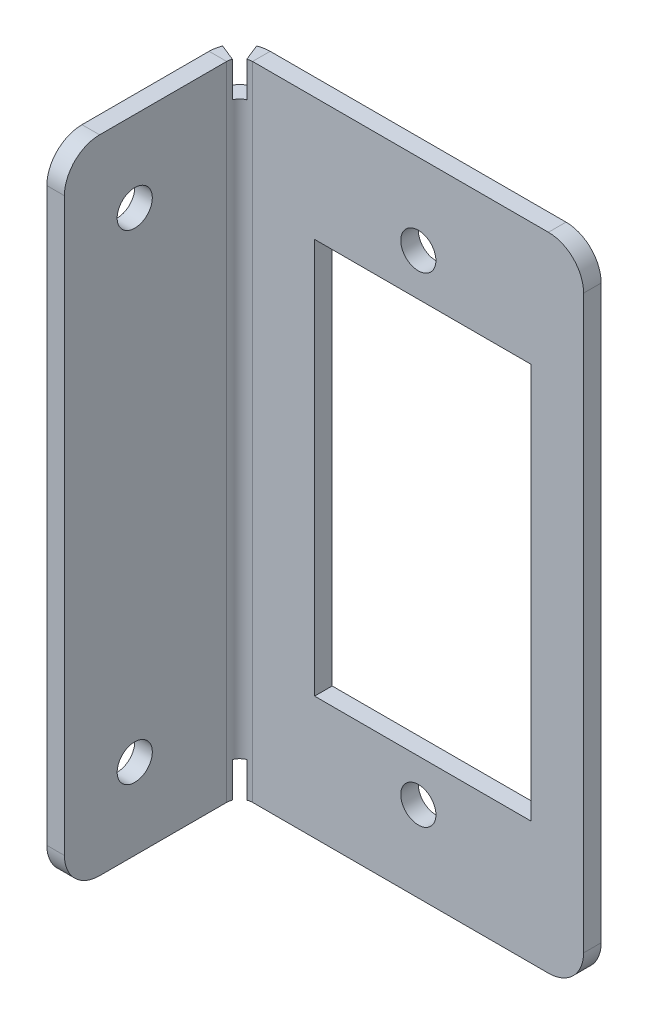
ISO-10303-21;
HEADER;
FILE_DESCRIPTION(('STEP AP214'),'2;1');
FILE_NAME('part.step','',(''),(''),'','','');
FILE_SCHEMA(('AUTOMOTIVE_DESIGN { 1 0 10303 214 1 1 1 1 }'));
ENDSEC;
DATA;
#1=APPLICATION_CONTEXT('core data for automotive mechanical design processes');
#2=APPLICATION_PROTOCOL_DEFINITION('international standard','automotive_design',2000,#1);
#3=PRODUCT_CONTEXT('',#1,'mechanical');
#4=PRODUCT('Part','Part','',(#3));
#5=PRODUCT_RELATED_PRODUCT_CATEGORY('part','',(#4));
#6=PRODUCT_DEFINITION_FORMATION('','',#4);
#7=PRODUCT_DEFINITION_CONTEXT('part definition',#1,'design');
#8=PRODUCT_DEFINITION('design','',#6,#7);
#9=PRODUCT_DEFINITION_SHAPE('','',#8);
#10=(LENGTH_UNIT() NAMED_UNIT(*) SI_UNIT(.MILLI.,.METRE.));
#11=(NAMED_UNIT(*) PLANE_ANGLE_UNIT() SI_UNIT($,.RADIAN.));
#12=(NAMED_UNIT(*) SI_UNIT($,.STERADIAN.) SOLID_ANGLE_UNIT());
#13=UNCERTAINTY_MEASURE_WITH_UNIT(LENGTH_MEASURE(1.E-05),#10,'distance_accuracy_value','');
#14=(GEOMETRIC_REPRESENTATION_CONTEXT(3) GLOBAL_UNCERTAINTY_ASSIGNED_CONTEXT((#13)) GLOBAL_UNIT_ASSIGNED_CONTEXT((#10,
#11,#12)) REPRESENTATION_CONTEXT('',''));
#15=CARTESIAN_POINT('',(0.,0.,0.));
#16=DIRECTION('',(0.,0.,1.));
#17=DIRECTION('',(1.,0.,0.));
#18=AXIS2_PLACEMENT_3D('',#15,#16,#17);
#19=CARTESIAN_POINT('',(176.999912259657,-94.9485687267,0.265376631142705));
#20=DIRECTION('',(0.,-1.,0.));
#21=DIRECTION('',(-1.,0.,0.));
#22=AXIS2_PLACEMENT_3D('',#19,#20,#21);
#23=PLANE('',#22);
#24=DIRECTION('',(0.,0.,-1.));
#25=VECTOR('',#24,1.);
#26=CARTESIAN_POINT('',(176.999912259657,-94.9485687267,0.265376631142705));
#27=LINE('',#26,#25);
#28=CARTESIAN_POINT('',(176.999912259657,-94.9485687267,7.96537663114272));
#29=VERTEX_POINT('',#28);
#30=CARTESIAN_POINT('',(176.999912259657,-94.9485687267,0.736600000000004));
#31=VERTEX_POINT('',#30);
#32=EDGE_CURVE('E380',#29,#31,#27,.T.);
#33=ORIENTED_EDGE('',*,*,#32,.T.);
#34=DIRECTION('',(1.,0.,0.));
#35=VECTOR('',#34,1.);
#36=CARTESIAN_POINT('',(176.999912259657,-94.9485687267,0.736600000000004));
#37=LINE('',#36,#35);
#38=CARTESIAN_POINT('',(177.999912259657,-94.9485687267,0.736600000000004));
#39=VERTEX_POINT('',#38);
#40=EDGE_CURVE('E12',#31,#39,#37,.T.);
#41=ORIENTED_EDGE('',*,*,#40,.T.);
#42=DIRECTION('',(0.,0.,-1.));
#43=VECTOR('',#42,1.);
#44=CARTESIAN_POINT('',(177.999912259657,-94.9485687267,0.265376631142705));
#45=LINE('',#44,#43);
#46=CARTESIAN_POINT('',(177.999912259657,-94.9485687267,7.96537663114272));
#47=VERTEX_POINT('',#46);
#48=EDGE_CURVE('E57',#47,#39,#45,.T.);
#49=ORIENTED_EDGE('',*,*,#48,.F.);
#50=DIRECTION('',(1.,0.,0.));
#51=VECTOR('',#50,1.);
#52=CARTESIAN_POINT('',(176.999912259657,-94.9485687267,7.96537663114272));
#53=LINE('',#52,#51);
#54=EDGE_CURVE('E388',#29,#47,#53,.T.);
#55=ORIENTED_EDGE('',*,*,#54,.F.);
#56=EDGE_LOOP('',(#33,#41,#49,#55));
#57=FACE_BOUND('',#56,.T.);
#58=ADVANCED_FACE('F41',(#57),#23,.T.);
#59=CARTESIAN_POINT('',(176.999912259657,-58.4483931478,7.96537663114272));
#60=DIRECTION('',(0.,1.,0.));
#61=DIRECTION('',(1.,0.,0.));
#62=AXIS2_PLACEMENT_3D('',#59,#60,#61);
#63=PLANE('',#62);
#64=DIRECTION('',(0.,0.,1.));
#65=VECTOR('',#64,1.);
#66=CARTESIAN_POINT('',(177.999912259657,-58.4483931478,7.96537663114272));
#67=LINE('',#66,#65);
#68=CARTESIAN_POINT('',(177.999912259657,-58.4483931478,0.736600000000004));
#69=VERTEX_POINT('',#68);
#70=CARTESIAN_POINT('',(177.999912259657,-58.4483931478,7.96537663114272));
#71=VERTEX_POINT('',#70);
#72=EDGE_CURVE('E64',#69,#71,#67,.T.);
#73=ORIENTED_EDGE('',*,*,#72,.F.);
#74=DIRECTION('',(-1.,0.,0.));
#75=VECTOR('',#74,1.);
#76=CARTESIAN_POINT('',(176.999912259657,-58.4483931478,0.736600000000004));
#77=LINE('',#76,#75);
#78=CARTESIAN_POINT('',(176.999912259657,-58.4483931478,0.736600000000041));
#79=VERTEX_POINT('',#78);
#80=EDGE_CURVE('E404',#69,#79,#77,.T.);
#81=ORIENTED_EDGE('',*,*,#80,.T.);
#82=DIRECTION('',(0.,0.,1.));
#83=VECTOR('',#82,1.);
#84=CARTESIAN_POINT('',(176.999912259657,-58.4483931478,7.96537663114272));
#85=LINE('',#84,#83);
#86=CARTESIAN_POINT('',(176.999912259657,-58.4483931478,7.96537663114272));
#87=VERTEX_POINT('',#86);
#88=EDGE_CURVE('E44',#79,#87,#85,.T.);
#89=ORIENTED_EDGE('',*,*,#88,.T.);
#90=DIRECTION('',(1.,0.,0.));
#91=VECTOR('',#90,1.);
#92=CARTESIAN_POINT('',(176.999912259657,-58.4483931478,7.96537663114272));
#93=LINE('',#92,#91);
#94=EDGE_CURVE('E400',#87,#71,#93,.T.);
#95=ORIENTED_EDGE('',*,*,#94,.T.);
#96=EDGE_LOOP('',(#73,#81,#89,#95));
#97=FACE_BOUND('',#96,.T.);
#98=ADVANCED_FACE('F415',(#97),#63,.T.);
#99=CARTESIAN_POINT('',(177.999912259657,-92.9485687267,7.96537663114269));
#100=DIRECTION('',(1.,0.,0.));
#101=DIRECTION('',(0.,0.,-1.));
#102=AXIS2_PLACEMENT_3D('',#99,#100,#101);
#103=PLANE('',#102);
#104=CARTESIAN_POINT('',(177.999912259657,-90.3485687267,5.96537663114272));
#105=DIRECTION('',(1.,0.,0.));
#106=DIRECTION('',(0.,0.,-1.));
#107=AXIS2_PLACEMENT_3D('',#104,#105,#106);
#108=CIRCLE('',#107,1.00000000000003);
#109=CARTESIAN_POINT('',(177.999912259657,-90.3485687267,4.96537663114269));
#110=VERTEX_POINT('',#109);
#111=EDGE_CURVE('E368',#110,#110,#108,.T.);
#112=ORIENTED_EDGE('',*,*,#111,.F.);
#113=EDGE_LOOP('',(#112));
#114=FACE_BOUND('',#113,.T.);
#115=CARTESIAN_POINT('',(177.999912259657,-63.0483931478,5.96537663114272));
#116=DIRECTION('',(1.,0.,0.));
#117=DIRECTION('',(0.,0.,-1.));
#118=AXIS2_PLACEMENT_3D('',#115,#116,#117);
#119=CIRCLE('',#118,1.);
#120=CARTESIAN_POINT('',(177.999912259657,-63.0483931478,4.96537663114271));
#121=VERTEX_POINT('',#120);
#122=EDGE_CURVE('E277',#121,#121,#119,.T.);
#123=ORIENTED_EDGE('',*,*,#122,.F.);
#124=EDGE_LOOP('',(#123));
#125=FACE_BOUND('',#124,.T.);
#126=ORIENTED_EDGE('',*,*,#48,.T.);
#127=DIRECTION('',(0.,1.,0.));
#128=VECTOR('',#127,1.);
#129=CARTESIAN_POINT('',(177.999912259657,-92.9485687267,0.736600000000004));
#130=LINE('',#129,#128);
#131=EDGE_CURVE('E49',#39,#69,#130,.T.);
#132=ORIENTED_EDGE('',*,*,#131,.T.);
#133=ORIENTED_EDGE('',*,*,#72,.T.);
#134=CARTESIAN_POINT('',(177.999912259657,-60.4483931478001,7.96537663114266));
#135=DIRECTION('',(1.,0.,0.));
#136=DIRECTION('',(0.,0.,-1.));
#137=AXIS2_PLACEMENT_3D('',#134,#135,#136);
#138=CIRCLE('',#137,2.00000000000006);
#139=CARTESIAN_POINT('',(177.999912259657,-60.4483931478,9.96537663114272));
#140=VERTEX_POINT('',#139);
#141=EDGE_CURVE('E390',#71,#140,#138,.T.);
#142=ORIENTED_EDGE('',*,*,#141,.T.);
#143=DIRECTION('',(0.,-1.,0.));
#144=VECTOR('',#143,1.);
#145=CARTESIAN_POINT('',(177.999912259657,-60.4483931478,9.96537663114272));
#146=LINE('',#145,#144);
#147=CARTESIAN_POINT('',(177.999912259657,-92.9485687267,9.96537663114272));
#148=VERTEX_POINT('',#147);
#149=EDGE_CURVE('E381',#140,#148,#146,.T.);
#150=ORIENTED_EDGE('',*,*,#149,.T.);
#151=CARTESIAN_POINT('',(177.999912259657,-92.9485687267,7.96537663114269));
#152=DIRECTION('',(1.,0.,0.));
#153=DIRECTION('',(0.,0.,-1.));
#154=AXIS2_PLACEMENT_3D('',#151,#152,#153);
#155=CIRCLE('',#154,2.00000000000003);
#156=EDGE_CURVE('E374',#148,#47,#155,.T.);
#157=ORIENTED_EDGE('',*,*,#156,.T.);
#158=EDGE_LOOP('',(#126,#132,#133,#142,#150,#157));
#159=FACE_BOUND('',#158,.T.);
#160=ADVANCED_FACE('F409',(#114,#125,#159),#103,.T.);
#161=CARTESIAN_POINT('',(176.999912259657,-92.9485687267,7.96537663114269));
#162=DIRECTION('',(1.,0.,0.));
#163=DIRECTION('',(0.,0.,-1.));
#164=AXIS2_PLACEMENT_3D('',#161,#162,#163);
#165=CYLINDRICAL_SURFACE('',#164,2.00000000000003);
#166=ORIENTED_EDGE('',*,*,#156,.F.);
#167=DIRECTION('',(1.,0.,0.));
#168=VECTOR('',#167,1.);
#169=CARTESIAN_POINT('',(176.999912259657,-92.9485687267,9.96537663114272));
#170=LINE('',#169,#168);
#171=CARTESIAN_POINT('',(176.999912259657,-92.9485687267,9.96537663114272));
#172=VERTEX_POINT('',#171);
#173=EDGE_CURVE('E395',#172,#148,#170,.T.);
#174=ORIENTED_EDGE('',*,*,#173,.F.);
#175=CARTESIAN_POINT('',(176.999912259657,-92.9485687267,7.96537663114269));
#176=DIRECTION('',(1.,0.,0.));
#177=DIRECTION('',(0.,0.,-1.));
#178=AXIS2_PLACEMENT_3D('',#175,#176,#177);
#179=CIRCLE('',#178,2.00000000000003);
#180=EDGE_CURVE('E377',#172,#29,#179,.T.);
#181=ORIENTED_EDGE('',*,*,#180,.T.);
#182=ORIENTED_EDGE('',*,*,#54,.T.);
#183=EDGE_LOOP('',(#166,#174,#181,#182));
#184=FACE_BOUND('',#183,.T.);
#185=ADVANCED_FACE('F425',(#184),#165,.T.);
#186=CARTESIAN_POINT('',(176.999912259657,-60.4483931478,9.96537663114272));
#187=DIRECTION('',(0.,0.,1.));
#188=DIRECTION('',(1.,0.,0.));
#189=AXIS2_PLACEMENT_3D('',#186,#187,#188);
#190=PLANE('',#189);
#191=ORIENTED_EDGE('',*,*,#149,.F.);
#192=DIRECTION('',(1.,0.,0.));
#193=VECTOR('',#192,1.);
#194=CARTESIAN_POINT('',(176.999912259657,-60.4483931478,9.96537663114272));
#195=LINE('',#194,#193);
#196=CARTESIAN_POINT('',(176.999912259657,-60.4483931478,9.96537663114272));
#197=VERTEX_POINT('',#196);
#198=EDGE_CURVE('E398',#197,#140,#195,.T.);
#199=ORIENTED_EDGE('',*,*,#198,.F.);
#200=DIRECTION('',(0.,-1.,0.));
#201=VECTOR('',#200,1.);
#202=CARTESIAN_POINT('',(176.999912259657,-60.4483931478,9.96537663114272));
#203=LINE('',#202,#201);
#204=EDGE_CURVE('E385',#197,#172,#203,.T.);
#205=ORIENTED_EDGE('',*,*,#204,.T.);
#206=ORIENTED_EDGE('',*,*,#173,.T.);
#207=EDGE_LOOP('',(#191,#199,#205,#206));
#208=FACE_BOUND('',#207,.T.);
#209=ADVANCED_FACE('F422',(#208),#190,.T.);
#210=CARTESIAN_POINT('',(176.999912259657,-60.4483931478001,7.96537663114266));
#211=DIRECTION('',(1.,0.,0.));
#212=DIRECTION('',(0.,0.,-1.));
#213=AXIS2_PLACEMENT_3D('',#210,#211,#212);
#214=CYLINDRICAL_SURFACE('',#213,2.00000000000006);
#215=ORIENTED_EDGE('',*,*,#141,.F.);
#216=ORIENTED_EDGE('',*,*,#94,.F.);
#217=CARTESIAN_POINT('',(176.999912259657,-60.4483931478001,7.96537663114266));
#218=DIRECTION('',(1.,0.,0.));
#219=DIRECTION('',(0.,0.,-1.));
#220=AXIS2_PLACEMENT_3D('',#217,#218,#219);
#221=CIRCLE('',#220,2.00000000000006);
#222=EDGE_CURVE('E382',#87,#197,#221,.T.);
#223=ORIENTED_EDGE('',*,*,#222,.T.);
#224=ORIENTED_EDGE('',*,*,#198,.T.);
#225=EDGE_LOOP('',(#215,#216,#223,#224));
#226=FACE_BOUND('',#225,.T.);
#227=ADVANCED_FACE('F419',(#226),#214,.T.);
#228=CARTESIAN_POINT('',(176.999912259657,-92.9485687267,7.96537663114269));
#229=DIRECTION('',(1.,0.,0.));
#230=DIRECTION('',(0.,0.,-1.));
#231=AXIS2_PLACEMENT_3D('',#228,#229,#230);
#232=PLANE('',#231);
#233=DIRECTION('',(0.,1.,0.));
#234=VECTOR('',#233,1.);
#235=CARTESIAN_POINT('',(176.999912259657,-92.9485687267,0.736600000000004));
#236=LINE('',#235,#234);
#237=EDGE_CURVE('E397',#31,#79,#236,.T.);
#238=ORIENTED_EDGE('',*,*,#237,.F.);
#239=ORIENTED_EDGE('',*,*,#32,.F.);
#240=ORIENTED_EDGE('',*,*,#180,.F.);
#241=ORIENTED_EDGE('',*,*,#204,.F.);
#242=ORIENTED_EDGE('',*,*,#222,.F.);
#243=ORIENTED_EDGE('',*,*,#88,.F.);
#244=EDGE_LOOP('',(#238,#239,#240,#241,#242,#243));
#245=FACE_BOUND('',#244,.T.);
#246=CARTESIAN_POINT('',(176.999912259657,-63.0483931478,5.96537663114272));
#247=DIRECTION('',(1.,0.,0.));
#248=DIRECTION('',(0.,0.,-1.));
#249=AXIS2_PLACEMENT_3D('',#246,#247,#248);
#250=CIRCLE('',#249,1.);
#251=CARTESIAN_POINT('',(176.999912259657,-63.0483931478,4.96537663114271));
#252=VERTEX_POINT('',#251);
#253=EDGE_CURVE('E365',#252,#252,#250,.T.);
#254=ORIENTED_EDGE('',*,*,#253,.T.);
#255=EDGE_LOOP('',(#254));
#256=FACE_BOUND('',#255,.T.);
#257=CARTESIAN_POINT('',(176.999912259657,-90.3485687267,5.96537663114272));
#258=DIRECTION('',(1.,0.,0.));
#259=DIRECTION('',(0.,0.,-1.));
#260=AXIS2_PLACEMENT_3D('',#257,#258,#259);
#261=CIRCLE('',#260,1.00000000000003);
#262=CARTESIAN_POINT('',(176.999912259657,-90.3485687267,4.96537663114269));
#263=VERTEX_POINT('',#262);
#264=EDGE_CURVE('E371',#263,#263,#261,.T.);
#265=ORIENTED_EDGE('',*,*,#264,.T.);
#266=EDGE_LOOP('',(#265));
#267=FACE_BOUND('',#266,.T.);
#268=ADVANCED_FACE('F440',(#245,#256,#267),#232,.F.);
#269=CARTESIAN_POINT('',(176.999912259657,-90.3485687267,5.96537663114272));
#270=DIRECTION('',(1.,0.,0.));
#271=DIRECTION('',(0.,0.,-1.));
#272=AXIS2_PLACEMENT_3D('',#269,#270,#271);
#273=CYLINDRICAL_SURFACE('',#272,1.00000000000003);
#274=ORIENTED_EDGE('',*,*,#264,.F.);
#275=EDGE_LOOP('',(#274));
#276=FACE_BOUND('',#275,.T.);
#277=ORIENTED_EDGE('',*,*,#111,.T.);
#278=EDGE_LOOP('',(#277));
#279=FACE_BOUND('',#278,.T.);
#280=ADVANCED_FACE('F507',(#276,#279),#273,.F.);
#281=CARTESIAN_POINT('',(176.999912259657,-63.0483931478,5.96537663114272));
#282=DIRECTION('',(1.,0.,0.));
#283=DIRECTION('',(0.,0.,-1.));
#284=AXIS2_PLACEMENT_3D('',#281,#282,#283);
#285=CYLINDRICAL_SURFACE('',#284,1.);
#286=ORIENTED_EDGE('',*,*,#253,.F.);
#287=EDGE_LOOP('',(#286));
#288=FACE_BOUND('',#287,.T.);
#289=ORIENTED_EDGE('',*,*,#122,.T.);
#290=EDGE_LOOP('',(#289));
#291=FACE_BOUND('',#290,.T.);
#292=ADVANCED_FACE('F516',(#288,#291),#285,.F.);
#293=CARTESIAN_POINT('',(195.5652888908,-92.9485687267,-1.));
#294=DIRECTION('',(0.,0.,1.));
#295=DIRECTION('',(1.,0.,0.));
#296=AXIS2_PLACEMENT_3D('',#293,#294,#295);
#297=CYLINDRICAL_SURFACE('',#296,2.);
#298=CARTESIAN_POINT('',(195.5652888908,-92.9485687267,0.));
#299=DIRECTION('',(0.,0.,1.));
#300=DIRECTION('',(1.,0.,0.));
#301=AXIS2_PLACEMENT_3D('',#298,#299,#300);
#302=CIRCLE('',#301,2.);
#303=CARTESIAN_POINT('',(195.5652888908,-94.9485687267,0.));
#304=VERTEX_POINT('',#303);
#305=CARTESIAN_POINT('',(197.5652888908,-92.9485687267,0.));
#306=VERTEX_POINT('',#305);
#307=EDGE_CURVE('E288',#304,#306,#302,.T.);
#308=ORIENTED_EDGE('',*,*,#307,.F.);
#309=DIRECTION('',(0.,0.,1.));
#310=VECTOR('',#309,1.);
#311=CARTESIAN_POINT('',(195.5652888908,-94.9485687267,-1.));
#312=LINE('',#311,#310);
#313=CARTESIAN_POINT('',(195.5652888908,-94.9485687267,-1.));
#314=VERTEX_POINT('',#313);
#315=EDGE_CURVE('E274',#314,#304,#312,.T.);
#316=ORIENTED_EDGE('',*,*,#315,.F.);
#317=CARTESIAN_POINT('',(195.5652888908,-92.9485687267,-1.));
#318=DIRECTION('',(0.,0.,1.));
#319=DIRECTION('',(1.,0.,0.));
#320=AXIS2_PLACEMENT_3D('',#317,#318,#319);
#321=CIRCLE('',#320,2.);
#322=CARTESIAN_POINT('',(197.5652888908,-92.9485687267,-1.));
#323=VERTEX_POINT('',#322);
#324=EDGE_CURVE('E354',#314,#323,#321,.T.);
#325=ORIENTED_EDGE('',*,*,#324,.T.);
#326=DIRECTION('',(0.,0.,1.));
#327=VECTOR('',#326,1.);
#328=CARTESIAN_POINT('',(197.5652888908,-92.9485687267,-1.));
#329=LINE('',#328,#327);
#330=EDGE_CURVE('E352',#323,#306,#329,.T.);
#331=ORIENTED_EDGE('',*,*,#330,.T.);
#332=EDGE_LOOP('',(#308,#316,#325,#331));
#333=FACE_BOUND('',#332,.T.);
#334=ADVANCED_FACE('F520',(#333),#297,.T.);
#335=CARTESIAN_POINT('',(197.5652888908,-92.9485687267,-1.));
#336=DIRECTION('',(1.,0.,0.));
#337=DIRECTION('',(0.,0.,-1.));
#338=AXIS2_PLACEMENT_3D('',#335,#336,#337);
#339=PLANE('',#338);
#340=DIRECTION('',(0.,1.,0.));
#341=VECTOR('',#340,1.);
#342=CARTESIAN_POINT('',(197.5652888908,-92.9485687267,0.));
#343=LINE('',#342,#341);
#344=CARTESIAN_POINT('',(197.5652888908,-60.4483931478,0.));
#345=VERTEX_POINT('',#344);
#346=EDGE_CURVE('E285',#306,#345,#343,.T.);
#347=ORIENTED_EDGE('',*,*,#346,.F.);
#348=ORIENTED_EDGE('',*,*,#330,.F.);
#349=DIRECTION('',(0.,1.,0.));
#350=VECTOR('',#349,1.);
#351=CARTESIAN_POINT('',(197.5652888908,-92.9485687267,-1.));
#352=LINE('',#351,#350);
#353=CARTESIAN_POINT('',(197.5652888908,-60.4483931478,-1.));
#354=VERTEX_POINT('',#353);
#355=EDGE_CURVE('E349',#323,#354,#352,.T.);
#356=ORIENTED_EDGE('',*,*,#355,.T.);
#357=DIRECTION('',(0.,0.,1.));
#358=VECTOR('',#357,1.);
#359=CARTESIAN_POINT('',(197.5652888908,-60.4483931478,-1.));
#360=LINE('',#359,#358);
#361=EDGE_CURVE('E347',#354,#345,#360,.T.);
#362=ORIENTED_EDGE('',*,*,#361,.T.);
#363=EDGE_LOOP('',(#347,#348,#356,#362));
#364=FACE_BOUND('',#363,.T.);
#365=ADVANCED_FACE('F564',(#364),#339,.T.);
#366=CARTESIAN_POINT('',(195.5652888908,-60.4483931478,-1.));
#367=DIRECTION('',(0.,0.,1.));
#368=DIRECTION('',(1.,0.,0.));
#369=AXIS2_PLACEMENT_3D('',#366,#367,#368);
#370=CYLINDRICAL_SURFACE('',#369,2.);
#371=CARTESIAN_POINT('',(195.5652888908,-60.4483931478,0.));
#372=DIRECTION('',(0.,0.,1.));
#373=DIRECTION('',(1.,0.,0.));
#374=AXIS2_PLACEMENT_3D('',#371,#372,#373);
#375=CIRCLE('',#374,2.);
#376=CARTESIAN_POINT('',(195.5652888908,-58.4483931478,0.));
#377=VERTEX_POINT('',#376);
#378=EDGE_CURVE('E282',#345,#377,#375,.T.);
#379=ORIENTED_EDGE('',*,*,#378,.F.);
#380=ORIENTED_EDGE('',*,*,#361,.F.);
#381=CARTESIAN_POINT('',(195.5652888908,-60.4483931478,-1.));
#382=DIRECTION('',(0.,0.,1.));
#383=DIRECTION('',(1.,0.,0.));
#384=AXIS2_PLACEMENT_3D('',#381,#382,#383);
#385=CIRCLE('',#384,2.);
#386=CARTESIAN_POINT('',(195.5652888908,-58.4483931478,-1.));
#387=VERTEX_POINT('',#386);
#388=EDGE_CURVE('E344',#354,#387,#385,.T.);
#389=ORIENTED_EDGE('',*,*,#388,.T.);
#390=DIRECTION('',(0.,0.,1.));
#391=VECTOR('',#390,1.);
#392=CARTESIAN_POINT('',(195.5652888908,-58.4483931478,-1.));
#393=LINE('',#392,#391);
#394=EDGE_CURVE('E342',#387,#377,#393,.T.);
#395=ORIENTED_EDGE('',*,*,#394,.T.);
#396=EDGE_LOOP('',(#379,#380,#389,#395));
#397=FACE_BOUND('',#396,.T.);
#398=ADVANCED_FACE('F560',(#397),#370,.T.);
#399=CARTESIAN_POINT('',(194.5652888908,-65.4483931478,-1.));
#400=DIRECTION('',(0.,1.,0.));
#401=DIRECTION('',(0.,0.,1.));
#402=AXIS2_PLACEMENT_3D('',#399,#400,#401);
#403=PLANE('',#402);
#404=DIRECTION('',(-1.,0.,0.));
#405=VECTOR('',#404,1.);
#406=CARTESIAN_POINT('',(194.5652888908,-65.4483931478,0.));
#407=LINE('',#406,#405);
#408=CARTESIAN_POINT('',(194.5652888908,-65.4483931478,0.));
#409=VERTEX_POINT('',#408);
#410=CARTESIAN_POINT('',(182.2652888908,-65.4483931478,0.));
#411=VERTEX_POINT('',#410);
#412=EDGE_CURVE('E339',#409,#411,#407,.T.);
#413=ORIENTED_EDGE('',*,*,#412,.T.);
#414=DIRECTION('',(0.,0.,1.));
#415=VECTOR('',#414,1.);
#416=CARTESIAN_POINT('',(182.2652888908,-65.4483931478,-1.));
#417=LINE('',#416,#415);
#418=CARTESIAN_POINT('',(182.2652888908,-65.4483931478,-1.));
#419=VERTEX_POINT('',#418);
#420=EDGE_CURVE('E322',#419,#411,#417,.T.);
#421=ORIENTED_EDGE('',*,*,#420,.F.);
#422=DIRECTION('',(-1.,0.,0.));
#423=VECTOR('',#422,1.);
#424=CARTESIAN_POINT('',(194.5652888908,-65.4483931478,-1.));
#425=LINE('',#424,#423);
#426=CARTESIAN_POINT('',(194.5652888908,-65.4483931478,-1.));
#427=VERTEX_POINT('',#426);
#428=EDGE_CURVE('E298',#427,#419,#425,.T.);
#429=ORIENTED_EDGE('',*,*,#428,.F.);
#430=DIRECTION('',(0.,0.,1.));
#431=VECTOR('',#430,1.);
#432=CARTESIAN_POINT('',(194.5652888908,-65.4483931478,-1.));
#433=LINE('',#432,#431);
#434=EDGE_CURVE('E337',#427,#409,#433,.T.);
#435=ORIENTED_EDGE('',*,*,#434,.T.);
#436=EDGE_LOOP('',(#413,#421,#429,#435));
#437=FACE_BOUND('',#436,.T.);
#438=ADVANCED_FACE('F556',(#437),#403,.F.);
#439=CARTESIAN_POINT('',(194.5652888908,-87.9485687267,-1.));
#440=DIRECTION('',(1.,0.,0.));
#441=DIRECTION('',(0.,0.,-1.));
#442=AXIS2_PLACEMENT_3D('',#439,#440,#441);
#443=PLANE('',#442);
#444=DIRECTION('',(0.,1.,0.));
#445=VECTOR('',#444,1.);
#446=CARTESIAN_POINT('',(194.5652888908,-87.9485687267,0.));
#447=LINE('',#446,#445);
#448=CARTESIAN_POINT('',(194.5652888908,-87.9485687267,0.));
#449=VERTEX_POINT('',#448);
#450=EDGE_CURVE('E334',#449,#409,#447,.T.);
#451=ORIENTED_EDGE('',*,*,#450,.T.);
#452=ORIENTED_EDGE('',*,*,#434,.F.);
#453=DIRECTION('',(0.,1.,0.));
#454=VECTOR('',#453,1.);
#455=CARTESIAN_POINT('',(194.5652888908,-87.9485687267,-1.));
#456=LINE('',#455,#454);
#457=CARTESIAN_POINT('',(194.5652888908,-87.9485687267,-1.));
#458=VERTEX_POINT('',#457);
#459=EDGE_CURVE('E301',#458,#427,#456,.T.);
#460=ORIENTED_EDGE('',*,*,#459,.F.);
#461=DIRECTION('',(0.,0.,1.));
#462=VECTOR('',#461,1.);
#463=CARTESIAN_POINT('',(194.5652888908,-87.9485687267,-1.));
#464=LINE('',#463,#462);
#465=EDGE_CURVE('E331',#458,#449,#464,.T.);
#466=ORIENTED_EDGE('',*,*,#465,.T.);
#467=EDGE_LOOP('',(#451,#452,#460,#466));
#468=FACE_BOUND('',#467,.T.);
#469=ADVANCED_FACE('F552',(#468),#443,.F.);
#470=CARTESIAN_POINT('',(182.2652888908,-87.9485687267,-1.));
#471=DIRECTION('',(0.,-1.,0.));
#472=DIRECTION('',(0.,0.,-1.));
#473=AXIS2_PLACEMENT_3D('',#470,#471,#472);
#474=PLANE('',#473);
#475=DIRECTION('',(1.,0.,0.));
#476=VECTOR('',#475,1.);
#477=CARTESIAN_POINT('',(182.2652888908,-87.9485687267,0.));
#478=LINE('',#477,#476);
#479=CARTESIAN_POINT('',(182.2652888908,-87.9485687267,0.));
#480=VERTEX_POINT('',#479);
#481=EDGE_CURVE('E329',#480,#449,#478,.T.);
#482=ORIENTED_EDGE('',*,*,#481,.T.);
#483=ORIENTED_EDGE('',*,*,#465,.F.);
#484=DIRECTION('',(1.,0.,0.));
#485=VECTOR('',#484,1.);
#486=CARTESIAN_POINT('',(182.2652888908,-87.9485687267,-1.));
#487=LINE('',#486,#485);
#488=CARTESIAN_POINT('',(182.2652888908,-87.9485687267,-1.));
#489=VERTEX_POINT('',#488);
#490=EDGE_CURVE('E304',#489,#458,#487,.T.);
#491=ORIENTED_EDGE('',*,*,#490,.F.);
#492=DIRECTION('',(0.,0.,1.));
#493=VECTOR('',#492,1.);
#494=CARTESIAN_POINT('',(182.2652888908,-87.9485687267,-1.));
#495=LINE('',#494,#493);
#496=EDGE_CURVE('E327',#489,#480,#495,.T.);
#497=ORIENTED_EDGE('',*,*,#496,.T.);
#498=EDGE_LOOP('',(#482,#483,#491,#497));
#499=FACE_BOUND('',#498,.T.);
#500=ADVANCED_FACE('F548',(#499),#474,.F.);
#501=CARTESIAN_POINT('',(182.2652888908,-65.4483931478,-1.));
#502=DIRECTION('',(-1.,0.,0.));
#503=DIRECTION('',(0.,0.,1.));
#504=AXIS2_PLACEMENT_3D('',#501,#502,#503);
#505=PLANE('',#504);
#506=DIRECTION('',(0.,-1.,0.));
#507=VECTOR('',#506,1.);
#508=CARTESIAN_POINT('',(182.2652888908,-65.4483931478,0.));
#509=LINE('',#508,#507);
#510=EDGE_CURVE('E324',#411,#480,#509,.T.);
#511=ORIENTED_EDGE('',*,*,#510,.T.);
#512=ORIENTED_EDGE('',*,*,#496,.F.);
#513=DIRECTION('',(0.,-1.,0.));
#514=VECTOR('',#513,1.);
#515=CARTESIAN_POINT('',(182.2652888908,-65.4483931478,-1.));
#516=LINE('',#515,#514);
#517=EDGE_CURVE('E307',#419,#489,#516,.T.);
#518=ORIENTED_EDGE('',*,*,#517,.F.);
#519=ORIENTED_EDGE('',*,*,#420,.T.);
#520=EDGE_LOOP('',(#511,#512,#518,#519));
#521=FACE_BOUND('',#520,.T.);
#522=ADVANCED_FACE('F544',(#521),#505,.F.);
#523=CARTESIAN_POINT('',(188.1652888908,-90.3485687267,-1.));
#524=DIRECTION('',(0.,0.,1.));
#525=DIRECTION('',(1.,0.,0.));
#526=AXIS2_PLACEMENT_3D('',#523,#524,#525);
#527=CYLINDRICAL_SURFACE('',#526,0.999999999999945);
#528=CARTESIAN_POINT('',(188.1652888908,-90.3485687267,-1.));
#529=DIRECTION('',(0.,0.,1.));
#530=DIRECTION('',(1.,0.,0.));
#531=AXIS2_PLACEMENT_3D('',#528,#529,#530);
#532=CIRCLE('',#531,0.999999999999945);
#533=CARTESIAN_POINT('',(189.1652888908,-90.3485687267,-1.));
#534=VERTEX_POINT('',#533);
#535=EDGE_CURVE('E310',#534,#534,#532,.T.);
#536=ORIENTED_EDGE('',*,*,#535,.F.);
#537=EDGE_LOOP('',(#536));
#538=FACE_BOUND('',#537,.T.);
#539=CARTESIAN_POINT('',(188.1652888908,-90.3485687267,0.));
#540=DIRECTION('',(0.,0.,1.));
#541=DIRECTION('',(1.,0.,0.));
#542=AXIS2_PLACEMENT_3D('',#539,#540,#541);
#543=CIRCLE('',#542,0.999999999999945);
#544=CARTESIAN_POINT('',(189.1652888908,-90.3485687267,0.));
#545=VERTEX_POINT('',#544);
#546=EDGE_CURVE('E319',#545,#545,#543,.T.);
#547=ORIENTED_EDGE('',*,*,#546,.T.);
#548=EDGE_LOOP('',(#547));
#549=FACE_BOUND('',#548,.T.);
#550=ADVANCED_FACE('F540',(#538,#549),#527,.F.);
#551=CARTESIAN_POINT('',(188.1652888908,-63.0483931478,-1.));
#552=DIRECTION('',(0.,0.,1.));
#553=DIRECTION('',(1.,0.,0.));
#554=AXIS2_PLACEMENT_3D('',#551,#552,#553);
#555=CYLINDRICAL_SURFACE('',#554,1.);
#556=CARTESIAN_POINT('',(188.1652888908,-63.0483931478,-1.));
#557=DIRECTION('',(0.,0.,1.));
#558=DIRECTION('',(1.,0.,0.));
#559=AXIS2_PLACEMENT_3D('',#556,#557,#558);
#560=CIRCLE('',#559,1.);
#561=CARTESIAN_POINT('',(189.1652888908,-63.0483931478,-1.));
#562=VERTEX_POINT('',#561);
#563=EDGE_CURVE('E313',#562,#562,#560,.T.);
#564=ORIENTED_EDGE('',*,*,#563,.F.);
#565=EDGE_LOOP('',(#564));
#566=FACE_BOUND('',#565,.T.);
#567=CARTESIAN_POINT('',(188.1652888908,-63.0483931478,0.));
#568=DIRECTION('',(0.,0.,1.));
#569=DIRECTION('',(1.,0.,0.));
#570=AXIS2_PLACEMENT_3D('',#567,#568,#569);
#571=CIRCLE('',#570,1.);
#572=CARTESIAN_POINT('',(189.1652888908,-63.0483931478,0.));
#573=VERTEX_POINT('',#572);
#574=EDGE_CURVE('E316',#573,#573,#571,.T.);
#575=ORIENTED_EDGE('',*,*,#574,.T.);
#576=EDGE_LOOP('',(#575));
#577=FACE_BOUND('',#576,.T.);
#578=ADVANCED_FACE('F536',(#566,#577),#555,.F.);
#579=CARTESIAN_POINT('',(169.5652888908,-92.9485687267,-1.));
#580=DIRECTION('',(0.,0.,1.));
#581=DIRECTION('',(1.,0.,0.));
#582=AXIS2_PLACEMENT_3D('',#579,#580,#581);
#583=PLANE('',#582);
#584=ORIENTED_EDGE('',*,*,#563,.T.);
#585=EDGE_LOOP('',(#584));
#586=FACE_BOUND('',#585,.T.);
#587=ORIENTED_EDGE('',*,*,#535,.T.);
#588=EDGE_LOOP('',(#587));
#589=FACE_BOUND('',#588,.T.);
#590=ORIENTED_EDGE('',*,*,#517,.T.);
#591=ORIENTED_EDGE('',*,*,#490,.T.);
#592=ORIENTED_EDGE('',*,*,#459,.T.);
#593=ORIENTED_EDGE('',*,*,#428,.T.);
#594=EDGE_LOOP('',(#590,#591,#592,#593));
#595=FACE_BOUND('',#594,.T.);
#596=DIRECTION('',(1.,0.,0.));
#597=VECTOR('',#596,1.);
#598=CARTESIAN_POINT('',(178.2652888908,-94.9485687267,-1.));
#599=LINE('',#598,#597);
#600=CARTESIAN_POINT('',(178.736512259657,-94.9485687267,-1.));
#601=VERTEX_POINT('',#600);
#602=EDGE_CURVE('E278',#601,#314,#599,.T.);
#603=ORIENTED_EDGE('',*,*,#602,.F.);
#604=DIRECTION('',(0.,1.,0.));
#605=VECTOR('',#604,1.);
#606=CARTESIAN_POINT('',(178.736512259657,-92.9485687267,-1.));
#607=LINE('',#606,#605);
#608=CARTESIAN_POINT('',(178.736512259657,-58.4483931478,-1.));
#609=VERTEX_POINT('',#608);
#610=EDGE_CURVE('E295',#601,#609,#607,.T.);
#611=ORIENTED_EDGE('',*,*,#610,.T.);
#612=DIRECTION('',(-1.,0.,0.));
#613=VECTOR('',#612,1.);
#614=CARTESIAN_POINT('',(195.5652888908,-58.4483931478,-1.));
#615=LINE('',#614,#613);
#616=EDGE_CURVE('E293',#387,#609,#615,.T.);
#617=ORIENTED_EDGE('',*,*,#616,.F.);
#618=ORIENTED_EDGE('',*,*,#388,.F.);
#619=ORIENTED_EDGE('',*,*,#355,.F.);
#620=ORIENTED_EDGE('',*,*,#324,.F.);
#621=EDGE_LOOP('',(#603,#611,#617,#618,#619,#620));
#622=FACE_BOUND('',#621,.T.);
#623=ADVANCED_FACE('F532',(#586,#589,#595,#622),#583,.F.);
#624=CARTESIAN_POINT('',(195.5652888908,-58.4483931478,-1.));
#625=DIRECTION('',(0.,1.,0.));
#626=DIRECTION('',(0.,0.,1.));
#627=AXIS2_PLACEMENT_3D('',#624,#625,#626);
#628=PLANE('',#627);
#629=DIRECTION('',(0.,0.,-1.));
#630=VECTOR('',#629,1.);
#631=CARTESIAN_POINT('',(178.736512259657,-58.4483931478,-1.));
#632=LINE('',#631,#630);
#633=CARTESIAN_POINT('',(178.736512259657,-58.4483931478,0.));
#634=VERTEX_POINT('',#633);
#635=EDGE_CURVE('E357',#634,#609,#632,.T.);
#636=ORIENTED_EDGE('',*,*,#635,.F.);
#637=DIRECTION('',(-1.,0.,0.));
#638=VECTOR('',#637,1.);
#639=CARTESIAN_POINT('',(195.5652888908,-58.4483931478,0.));
#640=LINE('',#639,#638);
#641=EDGE_CURVE('E280',#377,#634,#640,.T.);
#642=ORIENTED_EDGE('',*,*,#641,.F.);
#643=ORIENTED_EDGE('',*,*,#394,.F.);
#644=ORIENTED_EDGE('',*,*,#616,.T.);
#645=EDGE_LOOP('',(#636,#642,#643,#644));
#646=FACE_BOUND('',#645,.T.);
#647=ADVANCED_FACE('F529',(#646),#628,.T.);
#648=CARTESIAN_POINT('',(169.5652888908,-92.9485687267,0.));
#649=DIRECTION('',(0.,0.,1.));
#650=DIRECTION('',(1.,0.,0.));
#651=AXIS2_PLACEMENT_3D('',#648,#649,#650);
#652=PLANE('',#651);
#653=DIRECTION('',(0.,1.,0.));
#654=VECTOR('',#653,1.);
#655=CARTESIAN_POINT('',(178.736512259657,-92.9485687267,0.));
#656=LINE('',#655,#654);
#657=CARTESIAN_POINT('',(178.736512259657,-94.9485687267,0.));
#658=VERTEX_POINT('',#657);
#659=EDGE_CURVE('E360',#658,#634,#656,.T.);
#660=ORIENTED_EDGE('',*,*,#659,.F.);
#661=DIRECTION('',(1.,0.,0.));
#662=VECTOR('',#661,1.);
#663=CARTESIAN_POINT('',(178.2652888908,-94.9485687267,0.));
#664=LINE('',#663,#662);
#665=EDGE_CURVE('E291',#658,#304,#664,.T.);
#666=ORIENTED_EDGE('',*,*,#665,.T.);
#667=ORIENTED_EDGE('',*,*,#307,.T.);
#668=ORIENTED_EDGE('',*,*,#346,.T.);
#669=ORIENTED_EDGE('',*,*,#378,.T.);
#670=ORIENTED_EDGE('',*,*,#641,.T.);
#671=EDGE_LOOP('',(#660,#666,#667,#668,#669,#670));
#672=FACE_BOUND('',#671,.T.);
#673=ORIENTED_EDGE('',*,*,#481,.F.);
#674=ORIENTED_EDGE('',*,*,#510,.F.);
#675=ORIENTED_EDGE('',*,*,#412,.F.);
#676=ORIENTED_EDGE('',*,*,#450,.F.);
#677=EDGE_LOOP('',(#673,#674,#675,#676));
#678=FACE_BOUND('',#677,.T.);
#679=ORIENTED_EDGE('',*,*,#546,.F.);
#680=EDGE_LOOP('',(#679));
#681=FACE_BOUND('',#680,.T.);
#682=ORIENTED_EDGE('',*,*,#574,.F.);
#683=EDGE_LOOP('',(#682));
#684=FACE_BOUND('',#683,.T.);
#685=ADVANCED_FACE('F525',(#672,#678,#681,#684),#652,.T.);
#686=CARTESIAN_POINT('',(178.2652888908,-94.9485687267,-1.));
#687=DIRECTION('',(0.,-1.,0.));
#688=DIRECTION('',(0.,0.,-1.));
#689=AXIS2_PLACEMENT_3D('',#686,#687,#688);
#690=PLANE('',#689);
#691=DIRECTION('',(0.,0.,1.));
#692=VECTOR('',#691,1.);
#693=CARTESIAN_POINT('',(178.736512259657,-94.9485687267,-1.));
#694=LINE('',#693,#692);
#695=EDGE_CURVE('E213',#601,#658,#694,.T.);
#696=ORIENTED_EDGE('',*,*,#695,.F.);
#697=ORIENTED_EDGE('',*,*,#602,.T.);
#698=ORIENTED_EDGE('',*,*,#315,.T.);
#699=ORIENTED_EDGE('',*,*,#665,.F.);
#700=EDGE_LOOP('',(#696,#697,#698,#699));
#701=FACE_BOUND('',#700,.T.);
#702=ADVANCED_FACE('F522',(#701),#690,.T.);
#703=CARTESIAN_POINT('',(178.736512259657,-94.9485687267,0.7366));
#704=DIRECTION('',(0.,-1.,0.));
#705=DIRECTION('',(0.,0.,-1.));
#706=AXIS2_PLACEMENT_3D('',#703,#704,#705);
#707=PLANE('',#706);
#708=DIRECTION('',(-0.928269562946021,0.,-0.371908078035424));
#709=VECTOR('',#708,1.);
#710=CARTESIAN_POINT('',(177.124479336645,-94.9485687267,0.0907444316836797));
#711=LINE('',#710,#709);
#712=CARTESIAN_POINT('',(178.052748899591,-94.9485687267,0.462652509719105));
#713=VERTEX_POINT('',#712);
#714=CARTESIAN_POINT('',(177.124479336645,-94.9485687267,0.0907444316836797));
#715=VERTEX_POINT('',#714);
#716=EDGE_CURVE('E203',#713,#715,#711,.T.);
#717=ORIENTED_EDGE('',*,*,#716,.F.);
#718=CARTESIAN_POINT('',(178.736512259657,-94.9485687267,0.7366));
#719=DIRECTION('',(0.,1.,0.));
#720=DIRECTION('',(0.,0.,1.));
#721=AXIS2_PLACEMENT_3D('',#718,#719,#720);
#722=CIRCLE('',#721,0.7366);
#723=EDGE_CURVE('E261',#713,#39,#722,.T.);
#724=ORIENTED_EDGE('',*,*,#723,.T.);
#725=ORIENTED_EDGE('',*,*,#40,.F.);
#726=CARTESIAN_POINT('',(178.736512259657,-94.9485687267,0.7366));
#727=DIRECTION('',(0.,1.,0.));
#728=DIRECTION('',(0.,0.,-1.));
#729=AXIS2_PLACEMENT_3D('',#726,#727,#728);
#730=CIRCLE('',#729,1.73660000000001);
#731=EDGE_CURVE('E218',#715,#31,#730,.T.);
#732=ORIENTED_EDGE('',*,*,#731,.F.);
#733=EDGE_LOOP('',(#717,#724,#725,#732));
#734=FACE_BOUND('',#733,.T.);
#735=ADVANCED_FACE('F219',(#734),#707,.T.);
#736=CARTESIAN_POINT('',(178.736512259657,-58.4483931478,0.7366));
#737=DIRECTION('',(0.,1.,0.));
#738=DIRECTION('',(0.,0.,1.));
#739=AXIS2_PLACEMENT_3D('',#736,#737,#738);
#740=PLANE('',#739);
#741=ORIENTED_EDGE('',*,*,#80,.F.);
#742=CARTESIAN_POINT('',(178.736512259657,-58.4483931478,0.7366));
#743=DIRECTION('',(0.,1.,0.));
#744=DIRECTION('',(0.,0.,1.));
#745=AXIS2_PLACEMENT_3D('',#742,#743,#744);
#746=CIRCLE('',#745,0.7366);
#747=CARTESIAN_POINT('',(178.052748899591,-58.4483931478,0.462652509719105));
#748=VERTEX_POINT('',#747);
#749=EDGE_CURVE('E258',#69,#748,#746,.F.);
#750=ORIENTED_EDGE('',*,*,#749,.T.);
#751=DIRECTION('',(-0.928269562946021,0.,-0.371908078035424));
#752=VECTOR('',#751,1.);
#753=CARTESIAN_POINT('',(177.124479336645,-58.4483931478,0.0907444316836786));
#754=LINE('',#753,#752);
#755=CARTESIAN_POINT('',(177.124479336645,-58.4483931478,0.0907444316836786));
#756=VERTEX_POINT('',#755);
#757=EDGE_CURVE('E214',#748,#756,#754,.T.);
#758=ORIENTED_EDGE('',*,*,#757,.T.);
#759=CARTESIAN_POINT('',(178.736512259657,-58.4483931478,0.7366));
#760=DIRECTION('',(0.,-1.,0.));
#761=DIRECTION('',(0.,0.,1.));
#762=AXIS2_PLACEMENT_3D('',#759,#760,#761);
#763=CIRCLE('',#762,1.73660000000001);
#764=EDGE_CURVE('E222',#79,#756,#763,.T.);
#765=ORIENTED_EDGE('',*,*,#764,.F.);
#766=EDGE_LOOP('',(#741,#750,#758,#765));
#767=FACE_BOUND('',#766,.T.);
#768=ADVANCED_FACE('F436',(#767),#740,.T.);
#769=CARTESIAN_POINT('',(177.124479336645,-59.4483931478,0.0907444316836758));
#770=DIRECTION('',(0.371908078035426,0.,-0.92826956294602));
#771=DIRECTION('',(0.,-1.,0.));
#772=AXIS2_PLACEMENT_3D('',#769,#770,#771);
#773=PLANE('',#772);
#774=ORIENTED_EDGE('',*,*,#757,.F.);
#775=DIRECTION('',(0.,1.,0.));
#776=VECTOR('',#775,1.);
#777=CARTESIAN_POINT('',(178.052748899591,-113.263982665237,0.462652509719105));
#778=LINE('',#777,#776);
#779=CARTESIAN_POINT('',(178.052748899591,-60.4483931478,0.462652509719105));
#780=VERTEX_POINT('',#779);
#781=EDGE_CURVE('E255',#748,#780,#778,.F.);
#782=ORIENTED_EDGE('',*,*,#781,.T.);
#783=DIRECTION('',(-0.92826956294602,0.,-0.371908078035426));
#784=VECTOR('',#783,1.);
#785=CARTESIAN_POINT('',(177.124479336645,-60.4483931478,0.0907444316836758));
#786=LINE('',#785,#784);
#787=CARTESIAN_POINT('',(177.124479336645,-60.4483931478,0.0907444316836758));
#788=VERTEX_POINT('',#787);
#789=EDGE_CURVE('E271',#780,#788,#786,.T.);
#790=ORIENTED_EDGE('',*,*,#789,.T.);
#791=DIRECTION('',(0.,-1.,0.));
#792=VECTOR('',#791,1.);
#793=CARTESIAN_POINT('',(177.124479336645,-60.4483931478,0.0907444316836758));
#794=LINE('',#793,#792);
#795=EDGE_CURVE('E445',#756,#788,#794,.T.);
#796=ORIENTED_EDGE('',*,*,#795,.F.);
#797=EDGE_LOOP('',(#774,#782,#790,#796));
#798=FACE_BOUND('',#797,.T.);
#799=ADVANCED_FACE('F449',(#798),#773,.T.);
#800=CARTESIAN_POINT('',(178.736512259657,-60.4483931478,0.7366));
#801=DIRECTION('',(0.,1.,0.));
#802=DIRECTION('',(0.,0.,1.));
#803=AXIS2_PLACEMENT_3D('',#800,#801,#802);
#804=PLANE('',#803);
#805=ORIENTED_EDGE('',*,*,#789,.F.);
#806=CARTESIAN_POINT('',(178.736512259657,-60.4483931478,0.7366));
#807=DIRECTION('',(0.,1.,0.));
#808=DIRECTION('',(0.,0.,1.));
#809=AXIS2_PLACEMENT_3D('',#806,#807,#808);
#810=CIRCLE('',#809,0.7366);
#811=CARTESIAN_POINT('',(178.462564769376,-60.4483931478,0.0528366399339692));
#812=VERTEX_POINT('',#811);
#813=EDGE_CURVE('E252',#780,#812,#810,.F.);
#814=ORIENTED_EDGE('',*,*,#813,.T.);
#815=DIRECTION('',(-0.371908078035451,0.,-0.92826956294601));
#816=VECTOR('',#815,1.);
#817=CARTESIAN_POINT('',(178.090656691341,-60.4483931478,-0.875432923012046));
#818=LINE('',#817,#816);
#819=CARTESIAN_POINT('',(178.090656691341,-60.4483931478,-0.875432923012046));
#820=VERTEX_POINT('',#819);
#821=EDGE_CURVE('E269',#812,#820,#818,.T.);
#822=ORIENTED_EDGE('',*,*,#821,.T.);
#823=CARTESIAN_POINT('',(178.736512259657,-60.4483931478,0.7366));
#824=DIRECTION('',(0.,-1.,0.));
#825=DIRECTION('',(0.,0.,1.));
#826=AXIS2_PLACEMENT_3D('',#823,#824,#825);
#827=CIRCLE('',#826,1.73660000000001);
#828=EDGE_CURVE('E450',#788,#820,#827,.T.);
#829=ORIENTED_EDGE('',*,*,#828,.F.);
#830=EDGE_LOOP('',(#805,#814,#822,#829));
#831=FACE_BOUND('',#830,.T.);
#832=ADVANCED_FACE('F486',(#831),#804,.T.);
#833=CARTESIAN_POINT('',(178.090656691341,-59.4483931478,-0.87543292301204));
#834=DIRECTION('',(-0.92826956294601,0.,0.371908078035453));
#835=DIRECTION('',(0.,1.,0.));
#836=AXIS2_PLACEMENT_3D('',#833,#834,#835);
#837=PLANE('',#836);
#838=ORIENTED_EDGE('',*,*,#821,.F.);
#839=DIRECTION('',(0.,1.,0.));
#840=VECTOR('',#839,1.);
#841=CARTESIAN_POINT('',(178.462564769376,-113.263982665237,0.0528366399339692));
#842=LINE('',#841,#840);
#843=CARTESIAN_POINT('',(178.462564769376,-58.4483931478,0.0528366399339692));
#844=VERTEX_POINT('',#843);
#845=EDGE_CURVE('E249',#812,#844,#842,.T.);
#846=ORIENTED_EDGE('',*,*,#845,.T.);
#847=DIRECTION('',(-0.371908078035453,0.,-0.92826956294601));
#848=VECTOR('',#847,1.);
#849=CARTESIAN_POINT('',(178.090656691341,-58.4483931478,-0.87543292301204));
#850=LINE('',#849,#848);
#851=CARTESIAN_POINT('',(178.090656691341,-58.4483931478,-0.87543292301204));
#852=VERTEX_POINT('',#851);
#853=EDGE_CURVE('E267',#844,#852,#850,.T.);
#854=ORIENTED_EDGE('',*,*,#853,.T.);
#855=DIRECTION('',(0.,1.,0.));
#856=VECTOR('',#855,1.);
#857=CARTESIAN_POINT('',(178.090656691341,-58.4483931478,-0.87543292301204));
#858=LINE('',#857,#856);
#859=EDGE_CURVE('E452',#820,#852,#858,.T.);
#860=ORIENTED_EDGE('',*,*,#859,.F.);
#861=EDGE_LOOP('',(#838,#846,#854,#860));
#862=FACE_BOUND('',#861,.T.);
#863=ADVANCED_FACE('F484',(#862),#837,.T.);
#864=CARTESIAN_POINT('',(178.736512259657,-58.4483931478,0.7366));
#865=DIRECTION('',(0.,1.,0.));
#866=DIRECTION('',(0.,0.,1.));
#867=AXIS2_PLACEMENT_3D('',#864,#865,#866);
#868=PLANE('',#867);
#869=ORIENTED_EDGE('',*,*,#853,.F.);
#870=CARTESIAN_POINT('',(178.736512259657,-58.4483931478,0.7366));
#871=DIRECTION('',(0.,1.,0.));
#872=DIRECTION('',(0.,0.,1.));
#873=AXIS2_PLACEMENT_3D('',#870,#871,#872);
#874=CIRCLE('',#873,0.7366);
#875=EDGE_CURVE('E246',#844,#634,#874,.F.);
#876=ORIENTED_EDGE('',*,*,#875,.T.);
#877=ORIENTED_EDGE('',*,*,#635,.T.);
#878=CARTESIAN_POINT('',(178.736512259657,-58.4483931478,0.7366));
#879=DIRECTION('',(0.,-1.,0.));
#880=DIRECTION('',(0.,0.,1.));
#881=AXIS2_PLACEMENT_3D('',#878,#879,#880);
#882=CIRCLE('',#881,1.7366);
#883=EDGE_CURVE('E457',#852,#609,#882,.T.);
#884=ORIENTED_EDGE('',*,*,#883,.F.);
#885=EDGE_LOOP('',(#869,#876,#877,#884));
#886=FACE_BOUND('',#885,.T.);
#887=ADVANCED_FACE('F479',(#886),#868,.T.);
#888=CARTESIAN_POINT('',(178.736512259657,-94.9485687267,0.7366));
#889=DIRECTION('',(0.,-1.,0.));
#890=DIRECTION('',(0.,0.,-1.));
#891=AXIS2_PLACEMENT_3D('',#888,#889,#890);
#892=PLANE('',#891);
#893=ORIENTED_EDGE('',*,*,#695,.T.);
#894=CARTESIAN_POINT('',(178.736512259657,-94.9485687267,0.7366));
#895=DIRECTION('',(0.,1.,0.));
#896=DIRECTION('',(0.,0.,1.));
#897=AXIS2_PLACEMENT_3D('',#894,#895,#896);
#898=CIRCLE('',#897,0.7366);
#899=CARTESIAN_POINT('',(178.462564769376,-94.9485687267,0.0528366399339692));
#900=VERTEX_POINT('',#899);
#901=EDGE_CURVE('E243',#658,#900,#898,.T.);
#902=ORIENTED_EDGE('',*,*,#901,.T.);
#903=DIRECTION('',(-0.371908078035453,0.,-0.92826956294601));
#904=VECTOR('',#903,1.);
#905=CARTESIAN_POINT('',(178.090656691341,-94.9485687267,-0.87543292301204));
#906=LINE('',#905,#904);
#907=CARTESIAN_POINT('',(178.090656691341,-94.9485687267,-0.87543292301204));
#908=VERTEX_POINT('',#907);
#909=EDGE_CURVE('E265',#900,#908,#906,.T.);
#910=ORIENTED_EDGE('',*,*,#909,.T.);
#911=CARTESIAN_POINT('',(178.736512259657,-94.9485687267,0.7366));
#912=DIRECTION('',(0.,1.,0.));
#913=DIRECTION('',(0.,0.,-1.));
#914=AXIS2_PLACEMENT_3D('',#911,#912,#913);
#915=CIRCLE('',#914,1.7366);
#916=EDGE_CURVE('E460',#601,#908,#915,.T.);
#917=ORIENTED_EDGE('',*,*,#916,.F.);
#918=EDGE_LOOP('',(#893,#902,#910,#917));
#919=FACE_BOUND('',#918,.T.);
#920=ADVANCED_FACE('F472',(#919),#892,.T.);
#921=CARTESIAN_POINT('',(178.090656691341,-93.9485687267,-0.87543292301204));
#922=DIRECTION('',(-0.92826956294601,0.,0.371908078035453));
#923=DIRECTION('',(0.,1.,0.));
#924=AXIS2_PLACEMENT_3D('',#921,#922,#923);
#925=PLANE('',#924);
#926=ORIENTED_EDGE('',*,*,#909,.F.);
#927=DIRECTION('',(0.,1.,0.));
#928=VECTOR('',#927,1.);
#929=CARTESIAN_POINT('',(178.462564769376,-113.263982665237,0.0528366399339692));
#930=LINE('',#929,#928);
#931=CARTESIAN_POINT('',(178.462564769376,-92.9485687267,0.0528366399339692));
#932=VERTEX_POINT('',#931);
#933=EDGE_CURVE('E240',#900,#932,#930,.T.);
#934=ORIENTED_EDGE('',*,*,#933,.T.);
#935=DIRECTION('',(-0.371908078035453,0.,-0.92826956294601));
#936=VECTOR('',#935,1.);
#937=CARTESIAN_POINT('',(178.090656691341,-92.9485687267,-0.87543292301204));
#938=LINE('',#937,#936);
#939=CARTESIAN_POINT('',(178.090656691341,-92.9485687267,-0.87543292301204));
#940=VERTEX_POINT('',#939);
#941=EDGE_CURVE('E231',#932,#940,#938,.T.);
#942=ORIENTED_EDGE('',*,*,#941,.T.);
#943=DIRECTION('',(0.,1.,0.));
#944=VECTOR('',#943,1.);
#945=CARTESIAN_POINT('',(178.090656691341,-92.9485687267,-0.87543292301204));
#946=LINE('',#945,#944);
#947=EDGE_CURVE('E233',#908,#940,#946,.T.);
#948=ORIENTED_EDGE('',*,*,#947,.F.);
#949=EDGE_LOOP('',(#926,#934,#942,#948));
#950=FACE_BOUND('',#949,.T.);
#951=ADVANCED_FACE('F470',(#950),#925,.T.);
#952=CARTESIAN_POINT('',(178.736512259657,-92.9485687267,0.7366));
#953=DIRECTION('',(0.,-1.,0.));
#954=DIRECTION('',(0.,0.,-1.));
#955=AXIS2_PLACEMENT_3D('',#952,#953,#954);
#956=PLANE('',#955);
#957=ORIENTED_EDGE('',*,*,#941,.F.);
#958=CARTESIAN_POINT('',(178.736512259657,-92.9485687267,0.7366));
#959=DIRECTION('',(0.,1.,0.));
#960=DIRECTION('',(0.,0.,1.));
#961=AXIS2_PLACEMENT_3D('',#958,#959,#960);
#962=CIRCLE('',#961,0.7366);
#963=CARTESIAN_POINT('',(178.052748899591,-92.9485687267,0.462652509719105));
#964=VERTEX_POINT('',#963);
#965=EDGE_CURVE('E237',#932,#964,#962,.T.);
#966=ORIENTED_EDGE('',*,*,#965,.T.);
#967=DIRECTION('',(-0.928269562946022,0.,-0.371908078035422));
#968=VECTOR('',#967,1.);
#969=CARTESIAN_POINT('',(177.124479336645,-92.9485687267,0.0907444316836836));
#970=LINE('',#969,#968);
#971=CARTESIAN_POINT('',(177.124479336645,-92.9485687267,0.0907444316836836));
#972=VERTEX_POINT('',#971);
#973=EDGE_CURVE('E229',#964,#972,#970,.T.);
#974=ORIENTED_EDGE('',*,*,#973,.T.);
#975=CARTESIAN_POINT('',(178.736512259657,-92.9485687267,0.7366));
#976=DIRECTION('',(0.,1.,0.));
#977=DIRECTION('',(0.,0.,-1.));
#978=AXIS2_PLACEMENT_3D('',#975,#976,#977);
#979=CIRCLE('',#978,1.73660000000001);
#980=EDGE_CURVE('E228',#940,#972,#979,.T.);
#981=ORIENTED_EDGE('',*,*,#980,.F.);
#982=EDGE_LOOP('',(#957,#966,#974,#981));
#983=FACE_BOUND('',#982,.T.);
#984=ADVANCED_FACE('F467',(#983),#956,.T.);
#985=CARTESIAN_POINT('',(177.124479336645,-93.9485687267,0.0907444316836758));
#986=DIRECTION('',(0.371908078035426,0.,-0.92826956294602));
#987=DIRECTION('',(0.,-1.,0.));
#988=AXIS2_PLACEMENT_3D('',#985,#986,#987);
#989=PLANE('',#988);
#990=DIRECTION('',(0.,1.,0.));
#991=VECTOR('',#990,1.);
#992=CARTESIAN_POINT('',(178.052748899591,-113.263982665237,0.462652509719105));
#993=LINE('',#992,#991);
#994=EDGE_CURVE('E209',#964,#713,#993,.F.);
#995=ORIENTED_EDGE('',*,*,#994,.T.);
#996=ORIENTED_EDGE('',*,*,#716,.T.);
#997=DIRECTION('',(0.,-1.,0.));
#998=VECTOR('',#997,1.);
#999=CARTESIAN_POINT('',(177.124479336645,-94.9485687267,0.0907444316836758));
#1000=LINE('',#999,#998);
#1001=EDGE_CURVE('E207',#972,#715,#1000,.T.);
#1002=ORIENTED_EDGE('',*,*,#1001,.F.);
#1003=ORIENTED_EDGE('',*,*,#973,.F.);
#1004=EDGE_LOOP('',(#995,#996,#1002,#1003));
#1005=FACE_BOUND('',#1004,.T.);
#1006=ADVANCED_FACE('F205',(#1005),#989,.T.);
#1007=CARTESIAN_POINT('',(178.736512259657,-113.263982665237,0.7366));
#1008=DIRECTION('',(0.,1.,0.));
#1009=DIRECTION('',(0.,0.,1.));
#1010=AXIS2_PLACEMENT_3D('',#1007,#1008,#1009);
#1011=CYLINDRICAL_SURFACE('',#1010,1.7366);
#1012=ORIENTED_EDGE('',*,*,#980,.T.);
#1013=ORIENTED_EDGE('',*,*,#1001,.T.);
#1014=ORIENTED_EDGE('',*,*,#731,.T.);
#1015=ORIENTED_EDGE('',*,*,#237,.T.);
#1016=ORIENTED_EDGE('',*,*,#764,.T.);
#1017=ORIENTED_EDGE('',*,*,#795,.T.);
#1018=ORIENTED_EDGE('',*,*,#828,.T.);
#1019=ORIENTED_EDGE('',*,*,#859,.T.);
#1020=ORIENTED_EDGE('',*,*,#883,.T.);
#1021=ORIENTED_EDGE('',*,*,#610,.F.);
#1022=ORIENTED_EDGE('',*,*,#916,.T.);
#1023=ORIENTED_EDGE('',*,*,#947,.T.);
#1024=EDGE_LOOP('',(#1012,#1013,#1014,#1015,#1016,#1017,#1018,#1019,#1020,#1021,#1022,#1023));
#1025=FACE_BOUND('',#1024,.T.);
#1026=ADVANCED_FACE('F225',(#1025),#1011,.T.);
#1027=CARTESIAN_POINT('',(178.736512259657,-113.263982665237,0.7366));
#1028=DIRECTION('',(0.,1.,0.));
#1029=DIRECTION('',(0.,0.,1.));
#1030=AXIS2_PLACEMENT_3D('',#1027,#1028,#1029);
#1031=CYLINDRICAL_SURFACE('',#1030,0.7366);
#1032=ORIENTED_EDGE('',*,*,#965,.F.);
#1033=ORIENTED_EDGE('',*,*,#933,.F.);
#1034=ORIENTED_EDGE('',*,*,#901,.F.);
#1035=ORIENTED_EDGE('',*,*,#659,.T.);
#1036=ORIENTED_EDGE('',*,*,#875,.F.);
#1037=ORIENTED_EDGE('',*,*,#845,.F.);
#1038=ORIENTED_EDGE('',*,*,#813,.F.);
#1039=ORIENTED_EDGE('',*,*,#781,.F.);
#1040=ORIENTED_EDGE('',*,*,#749,.F.);
#1041=ORIENTED_EDGE('',*,*,#131,.F.);
#1042=ORIENTED_EDGE('',*,*,#723,.F.);
#1043=ORIENTED_EDGE('',*,*,#994,.F.);
#1044=EDGE_LOOP('',(#1032,#1033,#1034,#1035,#1036,#1037,#1038,#1039,#1040,#1041,#1042,#1043));
#1045=FACE_BOUND('',#1044,.T.);
#1046=ADVANCED_FACE('F432',(#1045),#1031,.F.);
#1047=CLOSED_SHELL('',(#58,#98,#160,#185,#209,#227,#268,#280,#292,#334,#365,#398,#438,#469,#500,
#522,#550,#578,#623,#647,#685,#702,#735,#768,#799,#832,#863,#887,#920,#951,#984,#1006,#1026,#1046));
#1048=MANIFOLD_SOLID_BREP('B2',#1047);
#1049=ADVANCED_BREP_SHAPE_REPRESENTATION('',(#18,#1048),#14);
#1050=SHAPE_DEFINITION_REPRESENTATION(#9,#1049);
ENDSEC;
END-ISO-10303-21;
